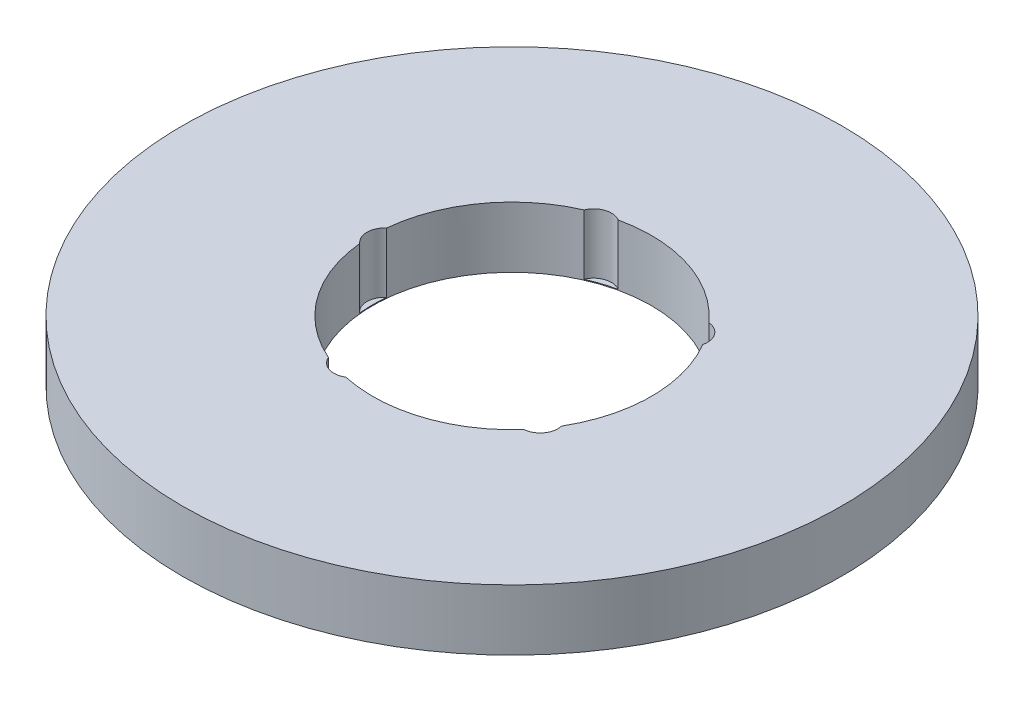
ISO-10303-21;
HEADER;
FILE_DESCRIPTION(('STEP AP214'),'2;1');
FILE_NAME('part.step','',(''),(''),'','','');
FILE_SCHEMA(('AUTOMOTIVE_DESIGN { 1 0 10303 214 1 1 1 1 }'));
ENDSEC;
DATA;
#1=APPLICATION_CONTEXT('core data for automotive mechanical design processes');
#2=APPLICATION_PROTOCOL_DEFINITION('international standard','automotive_design',2000,#1);
#3=PRODUCT_CONTEXT('',#1,'mechanical');
#4=PRODUCT('Part','Part','',(#3));
#5=PRODUCT_RELATED_PRODUCT_CATEGORY('part','',(#4));
#6=PRODUCT_DEFINITION_FORMATION('','',#4);
#7=PRODUCT_DEFINITION_CONTEXT('part definition',#1,'design');
#8=PRODUCT_DEFINITION('design','',#6,#7);
#9=PRODUCT_DEFINITION_SHAPE('','',#8);
#10=(LENGTH_UNIT() NAMED_UNIT(*) SI_UNIT(.MILLI.,.METRE.));
#11=(NAMED_UNIT(*) PLANE_ANGLE_UNIT() SI_UNIT($,.RADIAN.));
#12=(NAMED_UNIT(*) SI_UNIT($,.STERADIAN.) SOLID_ANGLE_UNIT());
#13=UNCERTAINTY_MEASURE_WITH_UNIT(LENGTH_MEASURE(1.E-05),#10,'distance_accuracy_value','');
#14=(GEOMETRIC_REPRESENTATION_CONTEXT(3) GLOBAL_UNCERTAINTY_ASSIGNED_CONTEXT((#13)) GLOBAL_UNIT_ASSIGNED_CONTEXT((#10,
#11,#12)) REPRESENTATION_CONTEXT('',''));
#15=CARTESIAN_POINT('',(0.,0.,0.));
#16=DIRECTION('',(0.,0.,1.));
#17=DIRECTION('',(1.,0.,0.));
#18=AXIS2_PLACEMENT_3D('',#15,#16,#17);
#19=CARTESIAN_POINT('',(0.,12.,0.));
#20=DIRECTION('',(0.,-1.,0.));
#21=DIRECTION('',(0.,0.,-1.));
#22=AXIS2_PLACEMENT_3D('',#19,#20,#21);
#23=CYLINDRICAL_SURFACE('',#22,65.);
#24=CARTESIAN_POINT('',(0.,12.,0.));
#25=DIRECTION('',(0.,1.,0.));
#26=DIRECTION('',(0.,0.,1.));
#27=AXIS2_PLACEMENT_3D('',#24,#25,#26);
#28=CIRCLE('',#27,65.);
#29=CARTESIAN_POINT('',(0.,12.,65.));
#30=VERTEX_POINT('',#29);
#31=EDGE_CURVE('E159',#30,#30,#28,.T.);
#32=ORIENTED_EDGE('',*,*,#31,.F.);
#33=EDGE_LOOP('',(#32));
#34=FACE_BOUND('',#33,.T.);
#35=CARTESIAN_POINT('',(0.,0.,0.));
#36=DIRECTION('',(0.,1.,0.));
#37=DIRECTION('',(0.,0.,1.));
#38=AXIS2_PLACEMENT_3D('',#35,#36,#37);
#39=CIRCLE('',#38,65.);
#40=CARTESIAN_POINT('',(0.,0.,65.));
#41=VERTEX_POINT('',#40);
#42=EDGE_CURVE('E152',#41,#41,#39,.T.);
#43=ORIENTED_EDGE('',*,*,#42,.T.);
#44=EDGE_LOOP('',(#43));
#45=FACE_BOUND('',#44,.T.);
#46=ADVANCED_FACE('F39',(#34,#45),#23,.T.);
#47=CARTESIAN_POINT('',(0.,12.,0.));
#48=DIRECTION('',(0.,1.,0.));
#49=DIRECTION('',(0.,0.,1.));
#50=AXIS2_PLACEMENT_3D('',#47,#48,#49);
#51=PLANE('',#50);
#52=CARTESIAN_POINT('',(-7.75453934282216,12.,23.8660180737818));
#53=DIRECTION('',(0.,1.,0.));
#54=DIRECTION('',(0.951056516295155,0.,0.309016994374945));
#55=AXIS2_PLACEMENT_3D('',#52,#53,#54);
#56=CIRCLE('',#55,3.5045795961541);
#57=CARTESIAN_POINT('',(-10.9921759673123,12.,25.2075795645604));
#58=VERTEX_POINT('',#57);
#59=CARTESIAN_POINT('',(-5.92378635132208,12.,26.8543991789779));
#60=VERTEX_POINT('',#59);
#61=EDGE_CURVE('E192',#58,#60,#56,.T.);
#62=ORIENTED_EDGE('',*,*,#61,.F.);
#63=CARTESIAN_POINT('',(0.,12.,0.));
#64=DIRECTION('',(0.,1.,0.));
#65=DIRECTION('',(0.,0.,1.));
#66=AXIS2_PLACEMENT_3D('',#63,#64,#65);
#67=CIRCLE('',#66,27.5);
#68=CARTESIAN_POINT('',(-27.3706019839631,12.,2.66461010946758));
#69=VERTEX_POINT('',#68);
#70=EDGE_CURVE('E147',#69,#58,#67,.T.);
#71=ORIENTED_EDGE('',*,*,#70,.F.);
#72=CARTESIAN_POINT('',(-25.0942164475693,12.,0.));
#73=DIRECTION('',(0.,1.,0.));
#74=DIRECTION('',(0.,0.,1.));
#75=AXIS2_PLACEMENT_3D('',#72,#73,#74);
#76=CIRCLE('',#75,3.5045795961541);
#77=CARTESIAN_POINT('',(-27.3706019839631,12.,-2.66461010946758));
#78=VERTEX_POINT('',#77);
#79=EDGE_CURVE('E154',#78,#69,#76,.T.);
#80=ORIENTED_EDGE('',*,*,#79,.F.);
#81=CARTESIAN_POINT('',(-10.9921759673126,12.,-25.2075795645602));
#82=VERTEX_POINT('',#81);
#83=EDGE_CURVE('E136',#82,#78,#67,.T.);
#84=ORIENTED_EDGE('',*,*,#83,.F.);
#85=CARTESIAN_POINT('',(-7.7545393428225,12.,-23.8660180737817));
#86=DIRECTION('',(0.,1.,0.));
#87=DIRECTION('',(-0.95105651629515,0.,0.309016994374958));
#88=AXIS2_PLACEMENT_3D('',#85,#86,#87);
#89=CIRCLE('',#88,3.5045795961541);
#90=CARTESIAN_POINT('',(-5.92378635132246,12.,-26.8543991789778));
#91=VERTEX_POINT('',#90);
#92=EDGE_CURVE('E117',#91,#82,#89,.T.);
#93=ORIENTED_EDGE('',*,*,#92,.F.);
#94=CARTESIAN_POINT('',(20.5770636258441,12.,-18.2437510544833));
#95=VERTEX_POINT('',#94);
#96=EDGE_CURVE('E133',#95,#91,#67,.T.);
#97=ORIENTED_EDGE('',*,*,#96,.F.);
#98=CARTESIAN_POINT('',(20.3016475666067,12.,-14.7500103457166));
#99=DIRECTION('',(0.,1.,0.));
#100=DIRECTION('',(-0.58778525229248,0.,-0.809016994374942));
#101=AXIS2_PLACEMENT_3D('',#98,#99,#100);
#102=CIRCLE('',#101,3.5045795961541);
#103=CARTESIAN_POINT('',(23.7095006767531,12.,-13.9323213305983));
#104=VERTEX_POINT('',#103);
#105=EDGE_CURVE('E333',#104,#95,#102,.T.);
#106=ORIENTED_EDGE('',*,*,#105,.F.);
#107=CARTESIAN_POINT('',(23.7095006767533,12.,13.9323213305979));
#108=VERTEX_POINT('',#107);
#109=EDGE_CURVE('E144',#108,#104,#67,.T.);
#110=ORIENTED_EDGE('',*,*,#109,.F.);
#111=CARTESIAN_POINT('',(20.301647566607,12.,14.7500103457163));
#112=DIRECTION('',(0.,1.,0.));
#113=DIRECTION('',(0.587785252292469,0.,-0.809016994374951));
#114=AXIS2_PLACEMENT_3D('',#111,#112,#113);
#115=CIRCLE('',#114,3.5045795961541);
#116=CARTESIAN_POINT('',(20.5770636258444,12.,18.243751054483));
#117=VERTEX_POINT('',#116);
#118=EDGE_CURVE('E328',#117,#108,#115,.T.);
#119=ORIENTED_EDGE('',*,*,#118,.F.);
#120=EDGE_CURVE('E146',#60,#117,#67,.T.);
#121=ORIENTED_EDGE('',*,*,#120,.F.);
#122=EDGE_LOOP('',(#62,#71,#80,#84,#93,#97,#106,#110,#119,#121));
#123=FACE_BOUND('',#122,.T.);
#124=ORIENTED_EDGE('',*,*,#31,.T.);
#125=EDGE_LOOP('',(#124));
#126=FACE_BOUND('',#125,.T.);
#127=ADVANCED_FACE('F131',(#123,#126),#51,.T.);
#128=CARTESIAN_POINT('',(0.,0.,0.));
#129=DIRECTION('',(0.,1.,0.));
#130=DIRECTION('',(0.,0.,1.));
#131=AXIS2_PLACEMENT_3D('',#128,#129,#130);
#132=PLANE('',#131);
#133=CARTESIAN_POINT('',(0.,0.,0.));
#134=DIRECTION('',(0.,1.,0.));
#135=DIRECTION('',(0.,0.,1.));
#136=AXIS2_PLACEMENT_3D('',#133,#134,#135);
#137=CIRCLE('',#136,27.5);
#138=CARTESIAN_POINT('',(0.,0.,27.5));
#139=VERTEX_POINT('',#138);
#140=EDGE_CURVE('E149',#139,#139,#137,.T.);
#141=ORIENTED_EDGE('',*,*,#140,.T.);
#142=EDGE_LOOP('',(#141));
#143=FACE_BOUND('',#142,.T.);
#144=ORIENTED_EDGE('',*,*,#42,.F.);
#145=EDGE_LOOP('',(#144));
#146=FACE_BOUND('',#145,.T.);
#147=ADVANCED_FACE('F209',(#143,#146),#132,.F.);
#148=CARTESIAN_POINT('',(0.,12.,0.));
#149=DIRECTION('',(0.,-1.,0.));
#150=DIRECTION('',(0.,0.,-1.));
#151=AXIS2_PLACEMENT_3D('',#148,#149,#150);
#152=CYLINDRICAL_SURFACE('',#151,27.5);
#153=DIRECTION('',(0.,1.,0.));
#154=VECTOR('',#153,1.);
#155=CARTESIAN_POINT('',(-10.9921759673122,6.0771919351267,25.2075795645604));
#156=LINE('',#155,#154);
#157=CARTESIAN_POINT('',(-10.9921759673123,0.154383870253405,25.2075795645604));
#158=VERTEX_POINT('',#157);
#159=EDGE_CURVE('E11',#158,#58,#156,.T.);
#160=ORIENTED_EDGE('',*,*,#159,.F.);
#161=CARTESIAN_POINT('',(0.,0.154383870253405,0.));
#162=DIRECTION('',(0.,1.,0.));
#163=DIRECTION('',(0.,0.,1.));
#164=AXIS2_PLACEMENT_3D('',#161,#162,#163);
#165=CIRCLE('',#164,27.5);
#166=CARTESIAN_POINT('',(-5.92378635132208,0.154383870253405,26.8543991789779));
#167=VERTEX_POINT('',#166);
#168=EDGE_CURVE('E187',#158,#167,#165,.T.);
#169=ORIENTED_EDGE('',*,*,#168,.T.);
#170=DIRECTION('',(0.,1.,0.));
#171=VECTOR('',#170,1.);
#172=CARTESIAN_POINT('',(-5.92378635132209,6.0771919351267,26.8543991789779));
#173=LINE('',#172,#171);
#174=EDGE_CURVE('E46',#60,#167,#173,.F.);
#175=ORIENTED_EDGE('',*,*,#174,.F.);
#176=ORIENTED_EDGE('',*,*,#120,.T.);
#177=DIRECTION('',(0.,1.,0.));
#178=VECTOR('',#177,1.);
#179=CARTESIAN_POINT('',(20.5770636258444,6.0771919351267,18.243751054483));
#180=LINE('',#179,#178);
#181=CARTESIAN_POINT('',(20.5770636258444,0.154383870253405,18.243751054483));
#182=VERTEX_POINT('',#181);
#183=EDGE_CURVE('E186',#182,#117,#180,.T.);
#184=ORIENTED_EDGE('',*,*,#183,.F.);
#185=CARTESIAN_POINT('',(0.,0.154383870253405,0.));
#186=DIRECTION('',(0.,1.,0.));
#187=DIRECTION('',(0.,0.,1.));
#188=AXIS2_PLACEMENT_3D('',#185,#186,#187);
#189=CIRCLE('',#188,27.5);
#190=CARTESIAN_POINT('',(23.7095006767533,0.154383870253405,13.9323213305979));
#191=VERTEX_POINT('',#190);
#192=EDGE_CURVE('E182',#182,#191,#189,.T.);
#193=ORIENTED_EDGE('',*,*,#192,.T.);
#194=DIRECTION('',(0.,1.,0.));
#195=VECTOR('',#194,1.);
#196=CARTESIAN_POINT('',(23.7095006767533,6.0771919351267,13.9323213305979));
#197=LINE('',#196,#195);
#198=EDGE_CURVE('E184',#108,#191,#197,.F.);
#199=ORIENTED_EDGE('',*,*,#198,.F.);
#200=ORIENTED_EDGE('',*,*,#109,.T.);
#201=DIRECTION('',(0.,1.,0.));
#202=VECTOR('',#201,1.);
#203=CARTESIAN_POINT('',(23.7095006767531,6.0771919351267,-13.9323213305983));
#204=LINE('',#203,#202);
#205=CARTESIAN_POINT('',(23.7095006767531,0.154383870253405,-13.9323213305983));
#206=VERTEX_POINT('',#205);
#207=EDGE_CURVE('E178',#206,#104,#204,.T.);
#208=ORIENTED_EDGE('',*,*,#207,.F.);
#209=CARTESIAN_POINT('',(0.,0.154383870253405,0.));
#210=DIRECTION('',(0.,1.,0.));
#211=DIRECTION('',(0.,0.,1.));
#212=AXIS2_PLACEMENT_3D('',#209,#210,#211);
#213=CIRCLE('',#212,27.5);
#214=CARTESIAN_POINT('',(20.5770636258441,0.154383870253405,-18.2437510544833));
#215=VERTEX_POINT('',#214);
#216=EDGE_CURVE('E123',#206,#215,#213,.T.);
#217=ORIENTED_EDGE('',*,*,#216,.T.);
#218=DIRECTION('',(0.,1.,0.));
#219=VECTOR('',#218,1.);
#220=CARTESIAN_POINT('',(20.5770636258442,6.0771919351267,-18.2437510544833));
#221=LINE('',#220,#219);
#222=EDGE_CURVE('E145',#95,#215,#221,.F.);
#223=ORIENTED_EDGE('',*,*,#222,.F.);
#224=ORIENTED_EDGE('',*,*,#96,.T.);
#225=DIRECTION('',(0.,1.,0.));
#226=VECTOR('',#225,1.);
#227=CARTESIAN_POINT('',(-5.92378635132248,6.0771919351267,-26.8543991789779));
#228=LINE('',#227,#226);
#229=CARTESIAN_POINT('',(-5.92378635132246,0.154383870253405,-26.8543991789778));
#230=VERTEX_POINT('',#229);
#231=EDGE_CURVE('E111',#230,#91,#228,.T.);
#232=ORIENTED_EDGE('',*,*,#231,.F.);
#233=CARTESIAN_POINT('',(0.,0.154383870253405,0.));
#234=DIRECTION('',(0.,1.,0.));
#235=DIRECTION('',(0.,0.,1.));
#236=AXIS2_PLACEMENT_3D('',#233,#234,#235);
#237=CIRCLE('',#236,27.5);
#238=CARTESIAN_POINT('',(-10.9921759673126,0.154383870253405,-25.2075795645602));
#239=VERTEX_POINT('',#238);
#240=EDGE_CURVE('E173',#230,#239,#237,.T.);
#241=ORIENTED_EDGE('',*,*,#240,.T.);
#242=DIRECTION('',(0.,1.,0.));
#243=VECTOR('',#242,1.);
#244=CARTESIAN_POINT('',(-10.9921759673126,6.0771919351267,-25.2075795645603));
#245=LINE('',#244,#243);
#246=EDGE_CURVE('E124',#82,#239,#245,.F.);
#247=ORIENTED_EDGE('',*,*,#246,.F.);
#248=ORIENTED_EDGE('',*,*,#83,.T.);
#249=DIRECTION('',(0.,1.,0.));
#250=VECTOR('',#249,1.);
#251=CARTESIAN_POINT('',(-27.3706019839631,6.0771919351267,-2.66461010946757));
#252=LINE('',#251,#250);
#253=CARTESIAN_POINT('',(-27.3706019839631,0.154383870253405,-2.66461010946758));
#254=VERTEX_POINT('',#253);
#255=EDGE_CURVE('E171',#254,#78,#252,.T.);
#256=ORIENTED_EDGE('',*,*,#255,.F.);
#257=CARTESIAN_POINT('',(0.,0.154383870253405,0.));
#258=DIRECTION('',(0.,1.,0.));
#259=DIRECTION('',(0.,0.,1.));
#260=AXIS2_PLACEMENT_3D('',#257,#258,#259);
#261=CIRCLE('',#260,27.5);
#262=CARTESIAN_POINT('',(-27.3706019839631,0.154383870253405,2.66461010946758));
#263=VERTEX_POINT('',#262);
#264=EDGE_CURVE('E162',#254,#263,#261,.T.);
#265=ORIENTED_EDGE('',*,*,#264,.T.);
#266=DIRECTION('',(0.,1.,0.));
#267=VECTOR('',#266,1.);
#268=CARTESIAN_POINT('',(-27.3706019839631,6.0771919351267,2.66461010946757));
#269=LINE('',#268,#267);
#270=EDGE_CURVE('E169',#69,#263,#269,.F.);
#271=ORIENTED_EDGE('',*,*,#270,.F.);
#272=ORIENTED_EDGE('',*,*,#70,.T.);
#273=EDGE_LOOP('',(#160,#169,#175,#176,#184,#193,#199,#200,#208,#217,#223,#224,#232,#241,#247,
#248,#256,#265,#271,#272));
#274=FACE_BOUND('',#273,.T.);
#275=ORIENTED_EDGE('',*,*,#140,.F.);
#276=EDGE_LOOP('',(#275));
#277=FACE_BOUND('',#276,.T.);
#278=ADVANCED_FACE('F139',(#274,#277),#152,.F.);
#279=CARTESIAN_POINT('',(-25.0942164475693,0.154383870253405,0.));
#280=DIRECTION('',(0.,1.,0.));
#281=DIRECTION('',(0.,0.,1.));
#282=AXIS2_PLACEMENT_3D('',#279,#280,#281);
#283=CYLINDRICAL_SURFACE('',#282,3.5045795961541);
#284=ORIENTED_EDGE('',*,*,#255,.T.);
#285=ORIENTED_EDGE('',*,*,#79,.T.);
#286=ORIENTED_EDGE('',*,*,#270,.T.);
#287=CARTESIAN_POINT('',(-25.0942164475693,0.154383870253405,0.));
#288=DIRECTION('',(0.,1.,0.));
#289=DIRECTION('',(0.,0.,1.));
#290=AXIS2_PLACEMENT_3D('',#287,#288,#289);
#291=CIRCLE('',#290,3.5045795961541);
#292=EDGE_CURVE('E157',#254,#263,#291,.T.);
#293=ORIENTED_EDGE('',*,*,#292,.F.);
#294=EDGE_LOOP('',(#284,#285,#286,#293));
#295=FACE_BOUND('',#294,.T.);
#296=ADVANCED_FACE('F222',(#295),#283,.F.);
#297=CARTESIAN_POINT('',(-25.0942164475693,0.154383870253405,0.));
#298=DIRECTION('',(0.,1.,0.));
#299=DIRECTION('',(0.,0.,1.));
#300=AXIS2_PLACEMENT_3D('',#297,#298,#299);
#301=PLANE('',#300);
#302=ORIENTED_EDGE('',*,*,#292,.T.);
#303=ORIENTED_EDGE('',*,*,#264,.F.);
#304=EDGE_LOOP('',(#302,#303));
#305=FACE_BOUND('',#304,.T.);
#306=ADVANCED_FACE('F223',(#305),#301,.T.);
#307=CARTESIAN_POINT('',(-7.7545393428225,0.154383870253405,-23.8660180737817));
#308=DIRECTION('',(0.,1.,0.));
#309=DIRECTION('',(0.,0.,1.));
#310=AXIS2_PLACEMENT_3D('',#307,#308,#309);
#311=CYLINDRICAL_SURFACE('',#310,3.5045795961541);
#312=ORIENTED_EDGE('',*,*,#231,.T.);
#313=ORIENTED_EDGE('',*,*,#92,.T.);
#314=ORIENTED_EDGE('',*,*,#246,.T.);
#315=CARTESIAN_POINT('',(-7.7545393428225,0.154383870253405,-23.8660180737817));
#316=DIRECTION('',(0.,1.,0.));
#317=DIRECTION('',(-0.95105651629515,0.,0.309016994374958));
#318=AXIS2_PLACEMENT_3D('',#315,#316,#317);
#319=CIRCLE('',#318,3.5045795961541);
#320=EDGE_CURVE('E119',#230,#239,#319,.T.);
#321=ORIENTED_EDGE('',*,*,#320,.F.);
#322=EDGE_LOOP('',(#312,#313,#314,#321));
#323=FACE_BOUND('',#322,.T.);
#324=ADVANCED_FACE('F116',(#323),#311,.F.);
#325=CARTESIAN_POINT('',(-7.7545393428225,0.154383870253405,-23.8660180737817));
#326=DIRECTION('',(0.,1.,0.));
#327=DIRECTION('',(-0.95105651629515,0.,0.309016994374958));
#328=AXIS2_PLACEMENT_3D('',#325,#326,#327);
#329=PLANE('',#328);
#330=ORIENTED_EDGE('',*,*,#320,.T.);
#331=ORIENTED_EDGE('',*,*,#240,.F.);
#332=EDGE_LOOP('',(#330,#331));
#333=FACE_BOUND('',#332,.T.);
#334=ADVANCED_FACE('F235',(#333),#329,.T.);
#335=CARTESIAN_POINT('',(20.3016475666067,0.154383870253405,-14.7500103457166));
#336=DIRECTION('',(0.,1.,0.));
#337=DIRECTION('',(0.,0.,1.));
#338=AXIS2_PLACEMENT_3D('',#335,#336,#337);
#339=CYLINDRICAL_SURFACE('',#338,3.5045795961541);
#340=ORIENTED_EDGE('',*,*,#207,.T.);
#341=ORIENTED_EDGE('',*,*,#105,.T.);
#342=ORIENTED_EDGE('',*,*,#222,.T.);
#343=CARTESIAN_POINT('',(20.3016475666067,0.154383870253405,-14.7500103457166));
#344=DIRECTION('',(0.,1.,0.));
#345=DIRECTION('',(-0.58778525229248,0.,-0.809016994374942));
#346=AXIS2_PLACEMENT_3D('',#343,#344,#345);
#347=CIRCLE('',#346,3.5045795961541);
#348=EDGE_CURVE('E335',#206,#215,#347,.T.);
#349=ORIENTED_EDGE('',*,*,#348,.F.);
#350=EDGE_LOOP('',(#340,#341,#342,#349));
#351=FACE_BOUND('',#350,.T.);
#352=ADVANCED_FACE('F234',(#351),#339,.F.);
#353=CARTESIAN_POINT('',(20.3016475666067,0.154383870253405,-14.7500103457166));
#354=DIRECTION('',(0.,1.,0.));
#355=DIRECTION('',(-0.58778525229248,0.,-0.809016994374942));
#356=AXIS2_PLACEMENT_3D('',#353,#354,#355);
#357=PLANE('',#356);
#358=ORIENTED_EDGE('',*,*,#348,.T.);
#359=ORIENTED_EDGE('',*,*,#216,.F.);
#360=EDGE_LOOP('',(#358,#359));
#361=FACE_BOUND('',#360,.T.);
#362=ADVANCED_FACE('F239',(#361),#357,.T.);
#363=CARTESIAN_POINT('',(20.301647566607,0.154383870253405,14.7500103457163));
#364=DIRECTION('',(0.,1.,0.));
#365=DIRECTION('',(0.,0.,1.));
#366=AXIS2_PLACEMENT_3D('',#363,#364,#365);
#367=CYLINDRICAL_SURFACE('',#366,3.5045795961541);
#368=ORIENTED_EDGE('',*,*,#183,.T.);
#369=ORIENTED_EDGE('',*,*,#118,.T.);
#370=ORIENTED_EDGE('',*,*,#198,.T.);
#371=CARTESIAN_POINT('',(20.301647566607,0.154383870253405,14.7500103457163));
#372=DIRECTION('',(0.,1.,0.));
#373=DIRECTION('',(0.587785252292469,0.,-0.809016994374951));
#374=AXIS2_PLACEMENT_3D('',#371,#372,#373);
#375=CIRCLE('',#374,3.5045795961541);
#376=EDGE_CURVE('E56',#182,#191,#375,.T.);
#377=ORIENTED_EDGE('',*,*,#376,.F.);
#378=EDGE_LOOP('',(#368,#369,#370,#377));
#379=FACE_BOUND('',#378,.T.);
#380=ADVANCED_FACE('F242',(#379),#367,.F.);
#381=CARTESIAN_POINT('',(20.301647566607,0.154383870253405,14.7500103457163));
#382=DIRECTION('',(0.,1.,0.));
#383=DIRECTION('',(0.587785252292469,0.,-0.809016994374951));
#384=AXIS2_PLACEMENT_3D('',#381,#382,#383);
#385=PLANE('',#384);
#386=ORIENTED_EDGE('',*,*,#376,.T.);
#387=ORIENTED_EDGE('',*,*,#192,.F.);
#388=EDGE_LOOP('',(#386,#387));
#389=FACE_BOUND('',#388,.T.);
#390=ADVANCED_FACE('F205',(#389),#385,.T.);
#391=CARTESIAN_POINT('',(-7.75453934282216,0.154383870253405,23.8660180737818));
#392=DIRECTION('',(0.,1.,0.));
#393=DIRECTION('',(0.,0.,1.));
#394=AXIS2_PLACEMENT_3D('',#391,#392,#393);
#395=CYLINDRICAL_SURFACE('',#394,3.5045795961541);
#396=ORIENTED_EDGE('',*,*,#159,.T.);
#397=ORIENTED_EDGE('',*,*,#61,.T.);
#398=ORIENTED_EDGE('',*,*,#174,.T.);
#399=CARTESIAN_POINT('',(-7.75453934282216,0.154383870253405,23.8660180737818));
#400=DIRECTION('',(0.,1.,0.));
#401=DIRECTION('',(0.951056516295155,0.,0.309016994374945));
#402=AXIS2_PLACEMENT_3D('',#399,#400,#401);
#403=CIRCLE('',#402,3.5045795961541);
#404=EDGE_CURVE('E55',#158,#167,#403,.T.);
#405=ORIENTED_EDGE('',*,*,#404,.F.);
#406=EDGE_LOOP('',(#396,#397,#398,#405));
#407=FACE_BOUND('',#406,.T.);
#408=ADVANCED_FACE('F195',(#407),#395,.F.);
#409=CARTESIAN_POINT('',(-7.75453934282216,0.154383870253405,23.8660180737818));
#410=DIRECTION('',(0.,1.,0.));
#411=DIRECTION('',(0.951056516295155,0.,0.309016994374945));
#412=AXIS2_PLACEMENT_3D('',#409,#410,#411);
#413=PLANE('',#412);
#414=ORIENTED_EDGE('',*,*,#404,.T.);
#415=ORIENTED_EDGE('',*,*,#168,.F.);
#416=EDGE_LOOP('',(#414,#415));
#417=FACE_BOUND('',#416,.T.);
#418=ADVANCED_FACE('F198',(#417),#413,.T.);
#419=CLOSED_SHELL('',(#46,#127,#147,#278,#296,#306,#324,#334,#352,#362,#380,#390,#408,#418));
#420=MANIFOLD_SOLID_BREP('B2',#419);
#421=ADVANCED_BREP_SHAPE_REPRESENTATION('',(#18,#420),#14);
#422=SHAPE_DEFINITION_REPRESENTATION(#9,#421);
ENDSEC;
END-ISO-10303-21;
